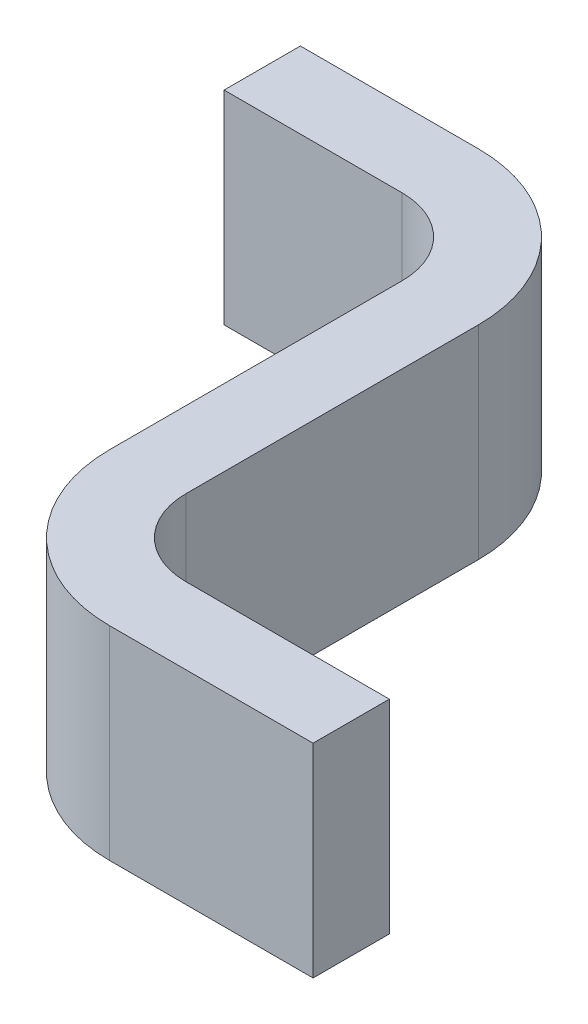
ISO-10303-21;
HEADER;
FILE_DESCRIPTION(('STEP AP214'),'2;1');
FILE_NAME('part.step','',(''),(''),'','','');
FILE_SCHEMA(('AUTOMOTIVE_DESIGN { 1 0 10303 214 1 1 1 1 }'));
ENDSEC;
DATA;
#1=APPLICATION_CONTEXT('core data for automotive mechanical design processes');
#2=APPLICATION_PROTOCOL_DEFINITION('international standard','automotive_design',2000,#1);
#3=PRODUCT_CONTEXT('',#1,'mechanical');
#4=PRODUCT('Part','Part','',(#3));
#5=PRODUCT_RELATED_PRODUCT_CATEGORY('part','',(#4));
#6=PRODUCT_DEFINITION_FORMATION('','',#4);
#7=PRODUCT_DEFINITION_CONTEXT('part definition',#1,'design');
#8=PRODUCT_DEFINITION('design','',#6,#7);
#9=PRODUCT_DEFINITION_SHAPE('','',#8);
#10=(LENGTH_UNIT() NAMED_UNIT(*) SI_UNIT(.MILLI.,.METRE.));
#11=(NAMED_UNIT(*) PLANE_ANGLE_UNIT() SI_UNIT($,.RADIAN.));
#12=(NAMED_UNIT(*) SI_UNIT($,.STERADIAN.) SOLID_ANGLE_UNIT());
#13=UNCERTAINTY_MEASURE_WITH_UNIT(LENGTH_MEASURE(1.E-05),#10,'distance_accuracy_value','');
#14=(GEOMETRIC_REPRESENTATION_CONTEXT(3) GLOBAL_UNCERTAINTY_ASSIGNED_CONTEXT((#13)) GLOBAL_UNIT_ASSIGNED_CONTEXT((#10,
#11,#12)) REPRESENTATION_CONTEXT('',''));
#15=CARTESIAN_POINT('',(0.,0.,0.));
#16=DIRECTION('',(0.,0.,1.));
#17=DIRECTION('',(1.,0.,0.));
#18=AXIS2_PLACEMENT_3D('',#15,#16,#17);
#19=CARTESIAN_POINT('',(-3.15,1.47,0.));
#20=DIRECTION('',(0.,1.,0.));
#21=DIRECTION('',(1.,0.,0.));
#22=AXIS2_PLACEMENT_3D('',#19,#20,#21);
#23=PLANE('',#22);
#24=DIRECTION('',(0.,0.,1.));
#25=VECTOR('',#24,1.);
#26=CARTESIAN_POINT('',(-2.75,1.47,1.175));
#27=LINE('',#26,#25);
#28=CARTESIAN_POINT('',(-2.75,1.47,0.3));
#29=VERTEX_POINT('',#28);
#30=CARTESIAN_POINT('',(-2.75,1.47,0.875));
#31=VERTEX_POINT('',#30);
#32=EDGE_CURVE('E11',#29,#31,#27,.T.);
#33=ORIENTED_EDGE('',*,*,#32,.F.);
#34=CARTESIAN_POINT('',(-3.05,1.47,0.3));
#35=DIRECTION('',(0.,-1.,0.));
#36=DIRECTION('',(0.,0.,1.));
#37=AXIS2_PLACEMENT_3D('',#34,#35,#36);
#38=CIRCLE('',#37,0.3);
#39=CARTESIAN_POINT('',(-3.05,1.47,0.));
#40=VERTEX_POINT('',#39);
#41=EDGE_CURVE('E170',#40,#29,#38,.T.);
#42=ORIENTED_EDGE('',*,*,#41,.F.);
#43=DIRECTION('',(-1.,0.,0.));
#44=VECTOR('',#43,1.);
#45=CARTESIAN_POINT('',(0.,1.47,0.));
#46=LINE('',#45,#44);
#47=CARTESIAN_POINT('',(-3.4,1.47,0.));
#48=VERTEX_POINT('',#47);
#49=EDGE_CURVE('E214',#40,#48,#46,.T.);
#50=ORIENTED_EDGE('',*,*,#49,.T.);
#51=DIRECTION('',(0.,0.,-1.));
#52=VECTOR('',#51,1.);
#53=CARTESIAN_POINT('',(-3.4,1.47,0.));
#54=LINE('',#53,#52);
#55=CARTESIAN_POINT('',(-3.4,1.47,0.15));
#56=VERTEX_POINT('',#55);
#57=EDGE_CURVE('E222',#56,#48,#54,.T.);
#58=ORIENTED_EDGE('',*,*,#57,.F.);
#59=DIRECTION('',(-1.,0.,0.));
#60=VECTOR('',#59,1.);
#61=CARTESIAN_POINT('',(0.,1.47,0.15));
#62=LINE('',#61,#60);
#63=CARTESIAN_POINT('',(-3.05,1.47,0.15));
#64=VERTEX_POINT('',#63);
#65=EDGE_CURVE('E229',#64,#56,#62,.T.);
#66=ORIENTED_EDGE('',*,*,#65,.F.);
#67=CARTESIAN_POINT('',(-3.05,1.47,0.3));
#68=DIRECTION('',(0.,-1.,0.));
#69=DIRECTION('',(0.,0.,1.));
#70=AXIS2_PLACEMENT_3D('',#67,#68,#69);
#71=CIRCLE('',#70,0.15);
#72=CARTESIAN_POINT('',(-2.9,1.47,0.3));
#73=VERTEX_POINT('',#72);
#74=EDGE_CURVE('E232',#64,#73,#71,.T.);
#75=ORIENTED_EDGE('',*,*,#74,.T.);
#76=DIRECTION('',(0.,0.,-1.));
#77=VECTOR('',#76,1.);
#78=CARTESIAN_POINT('',(-2.9,1.47,1.175));
#79=LINE('',#78,#77);
#80=CARTESIAN_POINT('',(-2.9,1.47,0.875));
#81=VERTEX_POINT('',#80);
#82=EDGE_CURVE('E240',#81,#73,#79,.T.);
#83=ORIENTED_EDGE('',*,*,#82,.F.);
#84=CARTESIAN_POINT('',(-2.6,1.47,0.875));
#85=DIRECTION('',(0.,-1.,0.));
#86=DIRECTION('',(0.,0.,-1.));
#87=AXIS2_PLACEMENT_3D('',#84,#85,#86);
#88=CIRCLE('',#87,0.3);
#89=CARTESIAN_POINT('',(-2.6,1.47,1.175));
#90=VERTEX_POINT('',#89);
#91=EDGE_CURVE('E184',#90,#81,#88,.T.);
#92=ORIENTED_EDGE('',*,*,#91,.F.);
#93=DIRECTION('',(-1.,0.,0.));
#94=VECTOR('',#93,1.);
#95=CARTESIAN_POINT('',(0.,1.47,1.175));
#96=LINE('',#95,#94);
#97=CARTESIAN_POINT('',(-2.2,1.47,1.175));
#98=VERTEX_POINT('',#97);
#99=EDGE_CURVE('E165',#98,#90,#96,.T.);
#100=ORIENTED_EDGE('',*,*,#99,.F.);
#101=DIRECTION('',(0.,0.,1.));
#102=VECTOR('',#101,1.);
#103=CARTESIAN_POINT('',(-2.2,1.47,1.1));
#104=LINE('',#103,#102);
#105=CARTESIAN_POINT('',(-2.2,1.47,1.025));
#106=VERTEX_POINT('',#105);
#107=EDGE_CURVE('E183',#106,#98,#104,.T.);
#108=ORIENTED_EDGE('',*,*,#107,.F.);
#109=DIRECTION('',(-1.,0.,0.));
#110=VECTOR('',#109,1.);
#111=CARTESIAN_POINT('',(0.,1.47,1.025));
#112=LINE('',#111,#110);
#113=CARTESIAN_POINT('',(-2.6,1.47,1.025));
#114=VERTEX_POINT('',#113);
#115=EDGE_CURVE('E179',#106,#114,#112,.T.);
#116=ORIENTED_EDGE('',*,*,#115,.T.);
#117=CARTESIAN_POINT('',(-2.6,1.47,0.875));
#118=DIRECTION('',(0.,-1.,0.));
#119=DIRECTION('',(0.,0.,1.));
#120=AXIS2_PLACEMENT_3D('',#117,#118,#119);
#121=CIRCLE('',#120,0.15);
#122=EDGE_CURVE('E47',#114,#31,#121,.T.);
#123=ORIENTED_EDGE('',*,*,#122,.T.);
#124=EDGE_LOOP('',(#33,#42,#50,#58,#66,#75,#83,#92,#100,#108,#116,#123));
#125=FACE_BOUND('',#124,.T.);
#126=ADVANCED_FACE('F17',(#125),#23,.T.);
#127=CARTESIAN_POINT('',(-2.75,1.27,1.175));
#128=DIRECTION('',(1.,0.,0.));
#129=DIRECTION('',(0.,1.,0.));
#130=AXIS2_PLACEMENT_3D('',#127,#128,#129);
#131=PLANE('',#130);
#132=DIRECTION('',(0.,-1.,0.));
#133=VECTOR('',#132,1.);
#134=CARTESIAN_POINT('',(-2.75,0.635,0.875));
#135=LINE('',#134,#133);
#136=CARTESIAN_POINT('',(-2.75,1.07,0.875));
#137=VERTEX_POINT('',#136);
#138=EDGE_CURVE('E26',#31,#137,#135,.T.);
#139=ORIENTED_EDGE('',*,*,#138,.T.);
#140=DIRECTION('',(0.,0.,1.));
#141=VECTOR('',#140,1.);
#142=CARTESIAN_POINT('',(-2.75,1.07,1.1));
#143=LINE('',#142,#141);
#144=CARTESIAN_POINT('',(-2.75,1.07,0.3));
#145=VERTEX_POINT('',#144);
#146=EDGE_CURVE('E138',#145,#137,#143,.T.);
#147=ORIENTED_EDGE('',*,*,#146,.F.);
#148=DIRECTION('',(0.,1.,0.));
#149=VECTOR('',#148,1.);
#150=CARTESIAN_POINT('',(-2.75,1.27,0.3));
#151=LINE('',#150,#149);
#152=EDGE_CURVE('E174',#145,#29,#151,.T.);
#153=ORIENTED_EDGE('',*,*,#152,.T.);
#154=ORIENTED_EDGE('',*,*,#32,.T.);
#155=EDGE_LOOP('',(#139,#147,#153,#154));
#156=FACE_BOUND('',#155,.T.);
#157=ADVANCED_FACE('F19',(#156),#131,.T.);
#158=CARTESIAN_POINT('',(-2.6,0.635,0.875));
#159=DIRECTION('',(0.,1.,0.));
#160=DIRECTION('',(0.,0.,1.));
#161=AXIS2_PLACEMENT_3D('',#158,#159,#160);
#162=CYLINDRICAL_SURFACE('',#161,0.15);
#163=ORIENTED_EDGE('',*,*,#122,.F.);
#164=DIRECTION('',(0.,-1.,0.));
#165=VECTOR('',#164,1.);
#166=CARTESIAN_POINT('',(-2.6,0.,1.025));
#167=LINE('',#166,#165);
#168=CARTESIAN_POINT('',(-2.6,1.07,1.025));
#169=VERTEX_POINT('',#168);
#170=EDGE_CURVE('E144',#114,#169,#167,.T.);
#171=ORIENTED_EDGE('',*,*,#170,.T.);
#172=CARTESIAN_POINT('',(-2.6,1.07,0.875));
#173=DIRECTION('',(0.,1.,0.));
#174=DIRECTION('',(0.,0.,1.));
#175=AXIS2_PLACEMENT_3D('',#172,#173,#174);
#176=CIRCLE('',#175,0.15);
#177=EDGE_CURVE('E142',#137,#169,#176,.T.);
#178=ORIENTED_EDGE('',*,*,#177,.F.);
#179=ORIENTED_EDGE('',*,*,#138,.F.);
#180=EDGE_LOOP('',(#163,#171,#178,#179));
#181=FACE_BOUND('',#180,.T.);
#182=ADVANCED_FACE('F143',(#181),#162,.F.);
#183=CARTESIAN_POINT('',(0.,0.,1.025));
#184=DIRECTION('',(0.,0.,1.));
#185=DIRECTION('',(1.,0.,0.));
#186=AXIS2_PLACEMENT_3D('',#183,#184,#185);
#187=PLANE('',#186);
#188=ORIENTED_EDGE('',*,*,#115,.F.);
#189=DIRECTION('',(0.,1.,0.));
#190=VECTOR('',#189,1.);
#191=CARTESIAN_POINT('',(-2.2,1.27,1.025));
#192=LINE('',#191,#190);
#193=CARTESIAN_POINT('',(-2.2,1.07,1.025));
#194=VERTEX_POINT('',#193);
#195=EDGE_CURVE('E167',#194,#106,#192,.T.);
#196=ORIENTED_EDGE('',*,*,#195,.F.);
#197=DIRECTION('',(1.,0.,0.));
#198=VECTOR('',#197,1.);
#199=CARTESIAN_POINT('',(-2.475,1.07,1.025));
#200=LINE('',#199,#198);
#201=EDGE_CURVE('E149',#169,#194,#200,.T.);
#202=ORIENTED_EDGE('',*,*,#201,.F.);
#203=ORIENTED_EDGE('',*,*,#170,.F.);
#204=EDGE_LOOP('',(#188,#196,#202,#203));
#205=FACE_BOUND('',#204,.T.);
#206=ADVANCED_FACE('F264',(#205),#187,.F.);
#207=CARTESIAN_POINT('',(-2.2,1.27,1.1));
#208=DIRECTION('',(1.,0.,0.));
#209=DIRECTION('',(0.,1.,0.));
#210=AXIS2_PLACEMENT_3D('',#207,#208,#209);
#211=PLANE('',#210);
#212=DIRECTION('',(0.,1.,0.));
#213=VECTOR('',#212,1.);
#214=CARTESIAN_POINT('',(-2.2,0.,1.175));
#215=LINE('',#214,#213);
#216=CARTESIAN_POINT('',(-2.2,1.07,1.175));
#217=VERTEX_POINT('',#216);
#218=EDGE_CURVE('E168',#217,#98,#215,.T.);
#219=ORIENTED_EDGE('',*,*,#218,.F.);
#220=DIRECTION('',(0.,0.,1.));
#221=VECTOR('',#220,1.);
#222=CARTESIAN_POINT('',(-2.2,1.07,1.1));
#223=LINE('',#222,#221);
#224=EDGE_CURVE('E178',#194,#217,#223,.T.);
#225=ORIENTED_EDGE('',*,*,#224,.F.);
#226=ORIENTED_EDGE('',*,*,#195,.T.);
#227=ORIENTED_EDGE('',*,*,#107,.T.);
#228=EDGE_LOOP('',(#219,#225,#226,#227));
#229=FACE_BOUND('',#228,.T.);
#230=ADVANCED_FACE('F269',(#229),#211,.T.);
#231=CARTESIAN_POINT('',(0.,0.,1.175));
#232=DIRECTION('',(0.,0.,1.));
#233=DIRECTION('',(1.,0.,0.));
#234=AXIS2_PLACEMENT_3D('',#231,#232,#233);
#235=PLANE('',#234);
#236=ORIENTED_EDGE('',*,*,#218,.T.);
#237=ORIENTED_EDGE('',*,*,#99,.T.);
#238=DIRECTION('',(0.,1.,0.));
#239=VECTOR('',#238,1.);
#240=CARTESIAN_POINT('',(-2.6,0.635,1.175));
#241=LINE('',#240,#239);
#242=CARTESIAN_POINT('',(-2.6,1.07,1.175));
#243=VERTEX_POINT('',#242);
#244=EDGE_CURVE('E187',#243,#90,#241,.T.);
#245=ORIENTED_EDGE('',*,*,#244,.F.);
#246=DIRECTION('',(-1.,0.,0.));
#247=VECTOR('',#246,1.);
#248=CARTESIAN_POINT('',(-2.475,1.07,1.175));
#249=LINE('',#248,#247);
#250=EDGE_CURVE('E191',#217,#243,#249,.T.);
#251=ORIENTED_EDGE('',*,*,#250,.F.);
#252=EDGE_LOOP('',(#236,#237,#245,#251));
#253=FACE_BOUND('',#252,.T.);
#254=ADVANCED_FACE('F271',(#253),#235,.T.);
#255=CARTESIAN_POINT('',(-2.6,0.635,0.875));
#256=DIRECTION('',(0.,-1.,0.));
#257=DIRECTION('',(0.,0.,-1.));
#258=AXIS2_PLACEMENT_3D('',#255,#256,#257);
#259=CYLINDRICAL_SURFACE('',#258,0.3);
#260=DIRECTION('',(0.,1.,0.));
#261=VECTOR('',#260,1.);
#262=CARTESIAN_POINT('',(-2.9,1.27,0.875));
#263=LINE('',#262,#261);
#264=CARTESIAN_POINT('',(-2.9,1.07,0.875));
#265=VERTEX_POINT('',#264);
#266=EDGE_CURVE('E239',#265,#81,#263,.T.);
#267=ORIENTED_EDGE('',*,*,#266,.F.);
#268=CARTESIAN_POINT('',(-2.6,1.07,0.875));
#269=DIRECTION('',(0.,-1.,0.));
#270=DIRECTION('',(0.,0.,-1.));
#271=AXIS2_PLACEMENT_3D('',#268,#269,#270);
#272=CIRCLE('',#271,0.3);
#273=EDGE_CURVE('E199',#243,#265,#272,.T.);
#274=ORIENTED_EDGE('',*,*,#273,.F.);
#275=ORIENTED_EDGE('',*,*,#244,.T.);
#276=ORIENTED_EDGE('',*,*,#91,.T.);
#277=EDGE_LOOP('',(#267,#274,#275,#276));
#278=FACE_BOUND('',#277,.T.);
#279=ADVANCED_FACE('F293',(#278),#259,.T.);
#280=CARTESIAN_POINT('',(-2.9,1.27,1.175));
#281=DIRECTION('',(-1.,0.,0.));
#282=DIRECTION('',(0.,0.,1.));
#283=AXIS2_PLACEMENT_3D('',#280,#281,#282);
#284=PLANE('',#283);
#285=ORIENTED_EDGE('',*,*,#266,.T.);
#286=ORIENTED_EDGE('',*,*,#82,.T.);
#287=DIRECTION('',(0.,-1.,0.));
#288=VECTOR('',#287,1.);
#289=CARTESIAN_POINT('',(-2.9,0.635,0.3));
#290=LINE('',#289,#288);
#291=CARTESIAN_POINT('',(-2.9,1.07,0.3));
#292=VERTEX_POINT('',#291);
#293=EDGE_CURVE('E236',#73,#292,#290,.T.);
#294=ORIENTED_EDGE('',*,*,#293,.T.);
#295=DIRECTION('',(0.,0.,-1.));
#296=VECTOR('',#295,1.);
#297=CARTESIAN_POINT('',(-2.9,1.07,1.1));
#298=LINE('',#297,#296);
#299=EDGE_CURVE('E203',#265,#292,#298,.T.);
#300=ORIENTED_EDGE('',*,*,#299,.F.);
#301=EDGE_LOOP('',(#285,#286,#294,#300));
#302=FACE_BOUND('',#301,.T.);
#303=ADVANCED_FACE('F289',(#302),#284,.T.);
#304=CARTESIAN_POINT('',(-3.05,0.635,0.3));
#305=DIRECTION('',(0.,1.,0.));
#306=DIRECTION('',(0.,0.,1.));
#307=AXIS2_PLACEMENT_3D('',#304,#305,#306);
#308=CYLINDRICAL_SURFACE('',#307,0.15);
#309=ORIENTED_EDGE('',*,*,#74,.F.);
#310=DIRECTION('',(0.,1.,0.));
#311=VECTOR('',#310,1.);
#312=CARTESIAN_POINT('',(-3.05,0.,0.15));
#313=LINE('',#312,#311);
#314=CARTESIAN_POINT('',(-3.05,1.07,0.15));
#315=VERTEX_POINT('',#314);
#316=EDGE_CURVE('E225',#315,#64,#313,.T.);
#317=ORIENTED_EDGE('',*,*,#316,.F.);
#318=CARTESIAN_POINT('',(-3.05,1.07,0.3));
#319=DIRECTION('',(0.,1.,0.));
#320=DIRECTION('',(0.,0.,1.));
#321=AXIS2_PLACEMENT_3D('',#318,#319,#320);
#322=CIRCLE('',#321,0.15);
#323=EDGE_CURVE('E204',#292,#315,#322,.T.);
#324=ORIENTED_EDGE('',*,*,#323,.F.);
#325=ORIENTED_EDGE('',*,*,#293,.F.);
#326=EDGE_LOOP('',(#309,#317,#324,#325));
#327=FACE_BOUND('',#326,.T.);
#328=ADVANCED_FACE('F298',(#327),#308,.F.);
#329=CARTESIAN_POINT('',(0.,0.,0.15));
#330=DIRECTION('',(0.,0.,1.));
#331=DIRECTION('',(1.,0.,0.));
#332=AXIS2_PLACEMENT_3D('',#329,#330,#331);
#333=PLANE('',#332);
#334=DIRECTION('',(0.,1.,0.));
#335=VECTOR('',#334,1.);
#336=CARTESIAN_POINT('',(-3.4,1.27,0.15));
#337=LINE('',#336,#335);
#338=CARTESIAN_POINT('',(-3.4,1.07,0.15));
#339=VERTEX_POINT('',#338);
#340=EDGE_CURVE('E218',#339,#56,#337,.T.);
#341=ORIENTED_EDGE('',*,*,#340,.F.);
#342=DIRECTION('',(-1.,0.,0.));
#343=VECTOR('',#342,1.);
#344=CARTESIAN_POINT('',(-2.475,1.07,0.15));
#345=LINE('',#344,#343);
#346=EDGE_CURVE('E208',#315,#339,#345,.T.);
#347=ORIENTED_EDGE('',*,*,#346,.F.);
#348=ORIENTED_EDGE('',*,*,#316,.T.);
#349=ORIENTED_EDGE('',*,*,#65,.T.);
#350=EDGE_LOOP('',(#341,#347,#348,#349));
#351=FACE_BOUND('',#350,.T.);
#352=ADVANCED_FACE('F466',(#351),#333,.T.);
#353=CARTESIAN_POINT('',(-3.4,1.27,0.));
#354=DIRECTION('',(-1.,0.,0.));
#355=DIRECTION('',(0.,0.,1.));
#356=AXIS2_PLACEMENT_3D('',#353,#354,#355);
#357=PLANE('',#356);
#358=DIRECTION('',(0.,-1.,0.));
#359=VECTOR('',#358,1.);
#360=CARTESIAN_POINT('',(-3.4,0.,0.));
#361=LINE('',#360,#359);
#362=CARTESIAN_POINT('',(-3.4,1.07,0.));
#363=VERTEX_POINT('',#362);
#364=EDGE_CURVE('E194',#48,#363,#361,.T.);
#365=ORIENTED_EDGE('',*,*,#364,.T.);
#366=DIRECTION('',(0.,0.,-1.));
#367=VECTOR('',#366,1.);
#368=CARTESIAN_POINT('',(-3.4,1.07,1.1));
#369=LINE('',#368,#367);
#370=EDGE_CURVE('E198',#339,#363,#369,.T.);
#371=ORIENTED_EDGE('',*,*,#370,.F.);
#372=ORIENTED_EDGE('',*,*,#340,.T.);
#373=ORIENTED_EDGE('',*,*,#57,.T.);
#374=EDGE_LOOP('',(#365,#371,#372,#373));
#375=FACE_BOUND('',#374,.T.);
#376=ADVANCED_FACE('F478',(#375),#357,.T.);
#377=CARTESIAN_POINT('',(0.,0.,0.));
#378=DIRECTION('',(0.,0.,1.));
#379=DIRECTION('',(1.,0.,0.));
#380=AXIS2_PLACEMENT_3D('',#377,#378,#379);
#381=PLANE('',#380);
#382=DIRECTION('',(1.,0.,0.));
#383=VECTOR('',#382,1.);
#384=CARTESIAN_POINT('',(-2.475,1.07,0.));
#385=LINE('',#384,#383);
#386=CARTESIAN_POINT('',(-3.05,1.07,0.));
#387=VERTEX_POINT('',#386);
#388=EDGE_CURVE('E161',#363,#387,#385,.T.);
#389=ORIENTED_EDGE('',*,*,#388,.F.);
#390=ORIENTED_EDGE('',*,*,#364,.F.);
#391=ORIENTED_EDGE('',*,*,#49,.F.);
#392=DIRECTION('',(0.,1.,0.));
#393=VECTOR('',#392,1.);
#394=CARTESIAN_POINT('',(-3.05,0.635,0.));
#395=LINE('',#394,#393);
#396=EDGE_CURVE('E175',#387,#40,#395,.T.);
#397=ORIENTED_EDGE('',*,*,#396,.F.);
#398=EDGE_LOOP('',(#389,#390,#391,#397));
#399=FACE_BOUND('',#398,.T.);
#400=ADVANCED_FACE('F453',(#399),#381,.F.);
#401=CARTESIAN_POINT('',(-3.05,0.635,0.3));
#402=DIRECTION('',(0.,1.,0.));
#403=DIRECTION('',(0.,0.,1.));
#404=AXIS2_PLACEMENT_3D('',#401,#402,#403);
#405=CYLINDRICAL_SURFACE('',#404,0.3);
#406=ORIENTED_EDGE('',*,*,#396,.T.);
#407=ORIENTED_EDGE('',*,*,#41,.T.);
#408=ORIENTED_EDGE('',*,*,#152,.F.);
#409=CARTESIAN_POINT('',(-3.05,1.07,0.3));
#410=DIRECTION('',(0.,-1.,0.));
#411=DIRECTION('',(0.,0.,1.));
#412=AXIS2_PLACEMENT_3D('',#409,#410,#411);
#413=CIRCLE('',#412,0.3);
#414=EDGE_CURVE('E154',#387,#145,#413,.T.);
#415=ORIENTED_EDGE('',*,*,#414,.F.);
#416=EDGE_LOOP('',(#406,#407,#408,#415));
#417=FACE_BOUND('',#416,.T.);
#418=ADVANCED_FACE('F441',(#417),#405,.T.);
#419=CARTESIAN_POINT('',(-2.475,1.07,1.1));
#420=DIRECTION('',(0.,-1.,0.));
#421=DIRECTION('',(0.,0.,-1.));
#422=AXIS2_PLACEMENT_3D('',#419,#420,#421);
#423=PLANE('',#422);
#424=ORIENTED_EDGE('',*,*,#388,.T.);
#425=ORIENTED_EDGE('',*,*,#414,.T.);
#426=ORIENTED_EDGE('',*,*,#146,.T.);
#427=ORIENTED_EDGE('',*,*,#177,.T.);
#428=ORIENTED_EDGE('',*,*,#201,.T.);
#429=ORIENTED_EDGE('',*,*,#224,.T.);
#430=ORIENTED_EDGE('',*,*,#250,.T.);
#431=ORIENTED_EDGE('',*,*,#273,.T.);
#432=ORIENTED_EDGE('',*,*,#299,.T.);
#433=ORIENTED_EDGE('',*,*,#323,.T.);
#434=ORIENTED_EDGE('',*,*,#346,.T.);
#435=ORIENTED_EDGE('',*,*,#370,.T.);
#436=EDGE_LOOP('',(#424,#425,#426,#427,#428,#429,#430,#431,#432,#433,#434,#435));
#437=FACE_BOUND('',#436,.T.);
#438=ADVANCED_FACE('F152',(#437),#423,.T.);
#439=CLOSED_SHELL('',(#126,#157,#182,#206,#230,#254,#279,#303,#328,#352,#376,#400,#418,#438));
#440=MANIFOLD_SOLID_BREP('B1',#439);
#441=ADVANCED_BREP_SHAPE_REPRESENTATION('',(#18,#440),#14);
#442=SHAPE_DEFINITION_REPRESENTATION(#9,#441);
ENDSEC;
END-ISO-10303-21;
